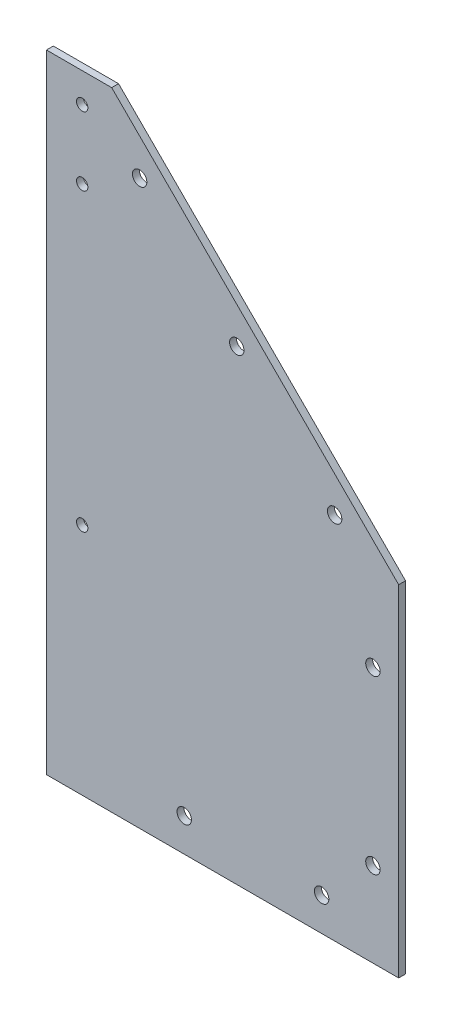
ISO-10303-21;
HEADER;
FILE_DESCRIPTION(('STEP AP214'),'2;1');
FILE_NAME('part.step','',(''),(''),'','','');
FILE_SCHEMA(('AUTOMOTIVE_DESIGN { 1 0 10303 214 1 1 1 1 }'));
ENDSEC;
DATA;
#1=APPLICATION_CONTEXT('core data for automotive mechanical design processes');
#2=APPLICATION_PROTOCOL_DEFINITION('international standard','automotive_design',2000,#1);
#3=PRODUCT_CONTEXT('',#1,'mechanical');
#4=PRODUCT('Part','Part','',(#3));
#5=PRODUCT_RELATED_PRODUCT_CATEGORY('part','',(#4));
#6=PRODUCT_DEFINITION_FORMATION('','',#4);
#7=PRODUCT_DEFINITION_CONTEXT('part definition',#1,'design');
#8=PRODUCT_DEFINITION('design','',#6,#7);
#9=PRODUCT_DEFINITION_SHAPE('','',#8);
#10=(LENGTH_UNIT() NAMED_UNIT(*) SI_UNIT(.MILLI.,.METRE.));
#11=(NAMED_UNIT(*) PLANE_ANGLE_UNIT() SI_UNIT($,.RADIAN.));
#12=(NAMED_UNIT(*) SI_UNIT($,.STERADIAN.) SOLID_ANGLE_UNIT());
#13=UNCERTAINTY_MEASURE_WITH_UNIT(LENGTH_MEASURE(1.E-05),#10,'distance_accuracy_value','');
#14=(GEOMETRIC_REPRESENTATION_CONTEXT(3) GLOBAL_UNCERTAINTY_ASSIGNED_CONTEXT((#13)) GLOBAL_UNIT_ASSIGNED_CONTEXT((#10,
#11,#12)) REPRESENTATION_CONTEXT('',''));
#15=CARTESIAN_POINT('',(0.,0.,0.));
#16=DIRECTION('',(0.,0.,1.));
#17=DIRECTION('',(1.,0.,0.));
#18=AXIS2_PLACEMENT_3D('',#15,#16,#17);
#19=CARTESIAN_POINT('',(0.,0.,2.));
#20=DIRECTION('',(0.,-1.,0.));
#21=DIRECTION('',(1.,0.,0.));
#22=AXIS2_PLACEMENT_3D('',#19,#20,#21);
#23=PLANE('',#22);
#24=DIRECTION('',(-1.,0.,0.));
#25=VECTOR('',#24,1.);
#26=CARTESIAN_POINT('',(0.,0.,0.));
#27=LINE('',#26,#25);
#28=CARTESIAN_POINT('',(83.56,0.,0.));
#29=VERTEX_POINT('',#28);
#30=CARTESIAN_POINT('',(-19.,0.,0.));
#31=VERTEX_POINT('',#30);
#32=EDGE_CURVE('E92',#29,#31,#27,.T.);
#33=ORIENTED_EDGE('',*,*,#32,.F.);
#34=DIRECTION('',(0.,0.,-1.));
#35=VECTOR('',#34,1.);
#36=CARTESIAN_POINT('',(83.56,0.,2.));
#37=LINE('',#36,#35);
#38=CARTESIAN_POINT('',(83.56,0.,2.));
#39=VERTEX_POINT('',#38);
#40=EDGE_CURVE('E11',#39,#29,#37,.T.);
#41=ORIENTED_EDGE('',*,*,#40,.F.);
#42=DIRECTION('',(-1.,0.,0.));
#43=VECTOR('',#42,1.);
#44=CARTESIAN_POINT('',(0.,0.,2.));
#45=LINE('',#44,#43);
#46=CARTESIAN_POINT('',(-19.,0.,2.));
#47=VERTEX_POINT('',#46);
#48=EDGE_CURVE('E89',#39,#47,#45,.T.);
#49=ORIENTED_EDGE('',*,*,#48,.T.);
#50=DIRECTION('',(0.,0.,1.));
#51=VECTOR('',#50,1.);
#52=CARTESIAN_POINT('',(-19.,0.,0.));
#53=LINE('',#52,#51);
#54=EDGE_CURVE('E206',#31,#47,#53,.T.);
#55=ORIENTED_EDGE('',*,*,#54,.F.);
#56=EDGE_LOOP('',(#33,#41,#49,#55));
#57=FACE_BOUND('',#56,.T.);
#58=ADVANCED_FACE('F37',(#57),#23,.T.);
#59=CARTESIAN_POINT('',(83.56,0.,2.));
#60=DIRECTION('',(1.,0.,0.));
#61=DIRECTION('',(0.,1.,0.));
#62=AXIS2_PLACEMENT_3D('',#59,#60,#61);
#63=PLANE('',#62);
#64=DIRECTION('',(0.,-1.,0.));
#65=VECTOR('',#64,1.);
#66=CARTESIAN_POINT('',(83.56,0.,0.));
#67=LINE('',#66,#65);
#68=CARTESIAN_POINT('',(83.56,99.17,0.));
#69=VERTEX_POINT('',#68);
#70=EDGE_CURVE('E126',#69,#29,#67,.T.);
#71=ORIENTED_EDGE('',*,*,#70,.F.);
#72=DIRECTION('',(0.,0.,-1.));
#73=VECTOR('',#72,1.);
#74=CARTESIAN_POINT('',(83.56,99.17,2.));
#75=LINE('',#74,#73);
#76=CARTESIAN_POINT('',(83.56,99.17,2.));
#77=VERTEX_POINT('',#76);
#78=EDGE_CURVE('E47',#77,#69,#75,.T.);
#79=ORIENTED_EDGE('',*,*,#78,.F.);
#80=DIRECTION('',(0.,-1.,0.));
#81=VECTOR('',#80,1.);
#82=CARTESIAN_POINT('',(83.56,0.,2.));
#83=LINE('',#82,#81);
#84=EDGE_CURVE('E98',#77,#39,#83,.T.);
#85=ORIENTED_EDGE('',*,*,#84,.T.);
#86=ORIENTED_EDGE('',*,*,#40,.T.);
#87=EDGE_LOOP('',(#71,#79,#85,#86));
#88=FACE_BOUND('',#87,.T.);
#89=ADVANCED_FACE('F103',(#88),#63,.T.);
#90=CARTESIAN_POINT('',(91.365,91.365,2.));
#91=DIRECTION('',(0.707106781186547,0.707106781186547,0.));
#92=DIRECTION('',(-0.707106781186548,0.707106781186548,0.));
#93=AXIS2_PLACEMENT_3D('',#90,#91,#92);
#94=PLANE('',#93);
#95=DIRECTION('',(0.707106781186548,-0.707106781186548,0.));
#96=VECTOR('',#95,1.);
#97=CARTESIAN_POINT('',(91.365,91.365,0.));
#98=LINE('',#97,#96);
#99=CARTESIAN_POINT('',(0.,182.73,0.));
#100=VERTEX_POINT('',#99);
#101=EDGE_CURVE('E128',#100,#69,#98,.T.);
#102=ORIENTED_EDGE('',*,*,#101,.F.);
#103=DIRECTION('',(0.,0.,-1.));
#104=VECTOR('',#103,1.);
#105=CARTESIAN_POINT('',(0.,182.73,2.));
#106=LINE('',#105,#104);
#107=CARTESIAN_POINT('',(0.,182.73,2.));
#108=VERTEX_POINT('',#107);
#109=EDGE_CURVE('E56',#108,#100,#106,.T.);
#110=ORIENTED_EDGE('',*,*,#109,.F.);
#111=DIRECTION('',(0.707106781186548,-0.707106781186548,0.));
#112=VECTOR('',#111,1.);
#113=CARTESIAN_POINT('',(91.365,91.365,2.));
#114=LINE('',#113,#112);
#115=EDGE_CURVE('E104',#108,#77,#114,.T.);
#116=ORIENTED_EDGE('',*,*,#115,.T.);
#117=ORIENTED_EDGE('',*,*,#78,.T.);
#118=EDGE_LOOP('',(#102,#110,#116,#117));
#119=FACE_BOUND('',#118,.T.);
#120=ADVANCED_FACE('F164',(#119),#94,.T.);
#121=CARTESIAN_POINT('',(8.13291965083095,163.990478631371,2.));
#122=DIRECTION('',(0.,0.,-1.));
#123=DIRECTION('',(-1.,0.,0.));
#124=AXIS2_PLACEMENT_3D('',#121,#122,#123);
#125=CYLINDRICAL_SURFACE('',#124,2.10000000000004);
#126=CARTESIAN_POINT('',(8.13291965083095,163.990478631371,2.));
#127=DIRECTION('',(0.,0.,1.));
#128=DIRECTION('',(1.,0.,0.));
#129=AXIS2_PLACEMENT_3D('',#126,#127,#128);
#130=CIRCLE('',#129,2.10000000000004);
#131=CARTESIAN_POINT('',(10.232919650831,163.990478631371,2.));
#132=VERTEX_POINT('',#131);
#133=EDGE_CURVE('E101',#132,#132,#130,.T.);
#134=ORIENTED_EDGE('',*,*,#133,.T.);
#135=EDGE_LOOP('',(#134));
#136=FACE_BOUND('',#135,.T.);
#137=CARTESIAN_POINT('',(8.13291965083095,163.990478631371,0.));
#138=DIRECTION('',(0.,0.,1.));
#139=DIRECTION('',(1.,0.,0.));
#140=AXIS2_PLACEMENT_3D('',#137,#138,#139);
#141=CIRCLE('',#140,2.10000000000004);
#142=CARTESIAN_POINT('',(10.232919650831,163.990478631371,0.));
#143=VERTEX_POINT('',#142);
#144=EDGE_CURVE('E122',#143,#143,#141,.T.);
#145=ORIENTED_EDGE('',*,*,#144,.F.);
#146=EDGE_LOOP('',(#145));
#147=FACE_BOUND('',#146,.T.);
#148=ADVANCED_FACE('F168',(#136,#147),#125,.F.);
#149=CARTESIAN_POINT('',(36.4171908982929,135.706207383909,2.));
#150=DIRECTION('',(0.,0.,-1.));
#151=DIRECTION('',(-1.,0.,0.));
#152=AXIS2_PLACEMENT_3D('',#149,#150,#151);
#153=CYLINDRICAL_SURFACE('',#152,2.09999999999999);
#154=CARTESIAN_POINT('',(36.4171908982929,135.706207383909,2.));
#155=DIRECTION('',(0.,0.,1.));
#156=DIRECTION('',(1.,0.,0.));
#157=AXIS2_PLACEMENT_3D('',#154,#155,#156);
#158=CIRCLE('',#157,2.09999999999999);
#159=CARTESIAN_POINT('',(38.5171908982928,135.706207383909,2.));
#160=VERTEX_POINT('',#159);
#161=EDGE_CURVE('E232',#160,#160,#158,.T.);
#162=ORIENTED_EDGE('',*,*,#161,.T.);
#163=EDGE_LOOP('',(#162));
#164=FACE_BOUND('',#163,.T.);
#165=CARTESIAN_POINT('',(36.4171908982929,135.706207383909,0.));
#166=DIRECTION('',(0.,0.,1.));
#167=DIRECTION('',(1.,0.,0.));
#168=AXIS2_PLACEMENT_3D('',#165,#166,#167);
#169=CIRCLE('',#168,2.09999999999999);
#170=CARTESIAN_POINT('',(38.5171908982928,135.706207383909,0.));
#171=VERTEX_POINT('',#170);
#172=EDGE_CURVE('E119',#171,#171,#169,.T.);
#173=ORIENTED_EDGE('',*,*,#172,.F.);
#174=EDGE_LOOP('',(#173));
#175=FACE_BOUND('',#174,.T.);
#176=ADVANCED_FACE('F171',(#164,#175),#153,.F.);
#177=CARTESIAN_POINT('',(64.9100261398927,107.42849037455,2.));
#178=DIRECTION('',(0.,0.,-1.));
#179=DIRECTION('',(-1.,0.,0.));
#180=AXIS2_PLACEMENT_3D('',#177,#178,#179);
#181=CYLINDRICAL_SURFACE('',#180,2.1);
#182=CARTESIAN_POINT('',(64.9100261398927,107.42849037455,2.));
#183=DIRECTION('',(0.,0.,1.));
#184=DIRECTION('',(1.,0.,0.));
#185=AXIS2_PLACEMENT_3D('',#182,#183,#184);
#186=CIRCLE('',#185,2.1);
#187=CARTESIAN_POINT('',(67.0100261398927,107.42849037455,2.));
#188=VERTEX_POINT('',#187);
#189=EDGE_CURVE('E229',#188,#188,#186,.T.);
#190=ORIENTED_EDGE('',*,*,#189,.T.);
#191=EDGE_LOOP('',(#190));
#192=FACE_BOUND('',#191,.T.);
#193=CARTESIAN_POINT('',(64.9100261398927,107.42849037455,0.));
#194=DIRECTION('',(0.,0.,1.));
#195=DIRECTION('',(1.,0.,0.));
#196=AXIS2_PLACEMENT_3D('',#193,#194,#195);
#197=CIRCLE('',#196,2.1);
#198=CARTESIAN_POINT('',(67.0100261398927,107.42849037455,0.));
#199=VERTEX_POINT('',#198);
#200=EDGE_CURVE('E116',#199,#199,#197,.T.);
#201=ORIENTED_EDGE('',*,*,#200,.F.);
#202=EDGE_LOOP('',(#201));
#203=FACE_BOUND('',#202,.T.);
#204=ADVANCED_FACE('F175',(#192,#203),#181,.F.);
#205=CARTESIAN_POINT('',(76.06,74.59,2.));
#206=DIRECTION('',(0.,0.,-1.));
#207=DIRECTION('',(-1.,0.,0.));
#208=AXIS2_PLACEMENT_3D('',#205,#206,#207);
#209=CYLINDRICAL_SURFACE('',#208,2.1);
#210=CARTESIAN_POINT('',(76.06,74.59,2.));
#211=DIRECTION('',(0.,0.,1.));
#212=DIRECTION('',(1.,0.,0.));
#213=AXIS2_PLACEMENT_3D('',#210,#211,#212);
#214=CIRCLE('',#213,2.1);
#215=CARTESIAN_POINT('',(78.16,74.59,2.));
#216=VERTEX_POINT('',#215);
#217=EDGE_CURVE('E189',#216,#216,#214,.T.);
#218=ORIENTED_EDGE('',*,*,#217,.T.);
#219=EDGE_LOOP('',(#218));
#220=FACE_BOUND('',#219,.T.);
#221=CARTESIAN_POINT('',(76.06,74.59,0.));
#222=DIRECTION('',(0.,0.,1.));
#223=DIRECTION('',(1.,0.,0.));
#224=AXIS2_PLACEMENT_3D('',#221,#222,#223);
#225=CIRCLE('',#224,2.1);
#226=CARTESIAN_POINT('',(78.16,74.59,0.));
#227=VERTEX_POINT('',#226);
#228=EDGE_CURVE('E112',#227,#227,#225,.T.);
#229=ORIENTED_EDGE('',*,*,#228,.F.);
#230=EDGE_LOOP('',(#229));
#231=FACE_BOUND('',#230,.T.);
#232=ADVANCED_FACE('F178',(#220,#231),#209,.F.);
#233=CARTESIAN_POINT('',(76.06,24.59,2.));
#234=DIRECTION('',(0.,0.,-1.));
#235=DIRECTION('',(-1.,0.,0.));
#236=AXIS2_PLACEMENT_3D('',#233,#234,#235);
#237=CYLINDRICAL_SURFACE('',#236,2.1);
#238=CARTESIAN_POINT('',(76.06,24.59,2.));
#239=DIRECTION('',(0.,0.,1.));
#240=DIRECTION('',(1.,0.,0.));
#241=AXIS2_PLACEMENT_3D('',#238,#239,#240);
#242=CIRCLE('',#241,2.1);
#243=CARTESIAN_POINT('',(78.16,24.59,2.));
#244=VERTEX_POINT('',#243);
#245=EDGE_CURVE('E131',#244,#244,#242,.T.);
#246=ORIENTED_EDGE('',*,*,#245,.T.);
#247=EDGE_LOOP('',(#246));
#248=FACE_BOUND('',#247,.T.);
#249=CARTESIAN_POINT('',(76.06,24.59,0.));
#250=DIRECTION('',(0.,0.,1.));
#251=DIRECTION('',(1.,0.,0.));
#252=AXIS2_PLACEMENT_3D('',#249,#250,#251);
#253=CIRCLE('',#252,2.1);
#254=CARTESIAN_POINT('',(78.16,24.59,0.));
#255=VERTEX_POINT('',#254);
#256=EDGE_CURVE('E109',#255,#255,#253,.T.);
#257=ORIENTED_EDGE('',*,*,#256,.F.);
#258=EDGE_LOOP('',(#257));
#259=FACE_BOUND('',#258,.T.);
#260=ADVANCED_FACE('F39',(#248,#259),#237,.F.);
#261=CARTESIAN_POINT('',(0.,0.,2.));
#262=DIRECTION('',(0.,0.,1.));
#263=DIRECTION('',(1.,0.,0.));
#264=AXIS2_PLACEMENT_3D('',#261,#262,#263);
#265=PLANE('',#264);
#266=CARTESIAN_POINT('',(-8.59,174.15,2.));
#267=DIRECTION('',(0.,0.,1.));
#268=DIRECTION('',(1.,0.,0.));
#269=AXIS2_PLACEMENT_3D('',#266,#267,#268);
#270=CIRCLE('',#269,1.64999999999999);
#271=CARTESIAN_POINT('',(-6.94000000000001,174.15,2.));
#272=VERTEX_POINT('',#271);
#273=EDGE_CURVE('E361',#272,#272,#270,.T.);
#274=ORIENTED_EDGE('',*,*,#273,.F.);
#275=EDGE_LOOP('',(#274));
#276=FACE_BOUND('',#275,.T.);
#277=CARTESIAN_POINT('',(-8.58999999999999,154.15,2.));
#278=DIRECTION('',(0.,0.,1.));
#279=DIRECTION('',(1.,0.,0.));
#280=AXIS2_PLACEMENT_3D('',#277,#278,#279);
#281=CIRCLE('',#280,1.64999999999999);
#282=CARTESIAN_POINT('',(-6.94,154.15,2.));
#283=VERTEX_POINT('',#282);
#284=EDGE_CURVE('E365',#283,#283,#281,.T.);
#285=ORIENTED_EDGE('',*,*,#284,.F.);
#286=EDGE_LOOP('',(#285));
#287=FACE_BOUND('',#286,.T.);
#288=CARTESIAN_POINT('',(-8.58999999999999,68.15,2.));
#289=DIRECTION('',(0.,0.,1.));
#290=DIRECTION('',(1.,0.,0.));
#291=AXIS2_PLACEMENT_3D('',#288,#289,#290);
#292=CIRCLE('',#291,1.64999999999999);
#293=CARTESIAN_POINT('',(-6.94,68.15,2.));
#294=VERTEX_POINT('',#293);
#295=EDGE_CURVE('E208',#294,#294,#292,.T.);
#296=ORIENTED_EDGE('',*,*,#295,.F.);
#297=EDGE_LOOP('',(#296));
#298=FACE_BOUND('',#297,.T.);
#299=CARTESIAN_POINT('',(21.12,9.69,2.));
#300=DIRECTION('',(0.,0.,1.));
#301=DIRECTION('',(1.,0.,0.));
#302=AXIS2_PLACEMENT_3D('',#299,#300,#301);
#303=CIRCLE('',#302,2.1);
#304=CARTESIAN_POINT('',(23.22,9.69,2.));
#305=VERTEX_POINT('',#304);
#306=EDGE_CURVE('E136',#305,#305,#303,.T.);
#307=ORIENTED_EDGE('',*,*,#306,.F.);
#308=EDGE_LOOP('',(#307));
#309=FACE_BOUND('',#308,.T.);
#310=CARTESIAN_POINT('',(61.12,9.69,2.));
#311=DIRECTION('',(0.,0.,1.));
#312=DIRECTION('',(1.,0.,0.));
#313=AXIS2_PLACEMENT_3D('',#310,#311,#312);
#314=CIRCLE('',#313,2.1);
#315=CARTESIAN_POINT('',(63.22,9.69,2.));
#316=VERTEX_POINT('',#315);
#317=EDGE_CURVE('E222',#316,#316,#314,.T.);
#318=ORIENTED_EDGE('',*,*,#317,.F.);
#319=EDGE_LOOP('',(#318));
#320=FACE_BOUND('',#319,.T.);
#321=ORIENTED_EDGE('',*,*,#245,.F.);
#322=EDGE_LOOP('',(#321));
#323=FACE_BOUND('',#322,.T.);
#324=ORIENTED_EDGE('',*,*,#217,.F.);
#325=EDGE_LOOP('',(#324));
#326=FACE_BOUND('',#325,.T.);
#327=ORIENTED_EDGE('',*,*,#189,.F.);
#328=EDGE_LOOP('',(#327));
#329=FACE_BOUND('',#328,.T.);
#330=ORIENTED_EDGE('',*,*,#161,.F.);
#331=EDGE_LOOP('',(#330));
#332=FACE_BOUND('',#331,.T.);
#333=ORIENTED_EDGE('',*,*,#133,.F.);
#334=EDGE_LOOP('',(#333));
#335=FACE_BOUND('',#334,.T.);
#336=ORIENTED_EDGE('',*,*,#48,.F.);
#337=ORIENTED_EDGE('',*,*,#84,.F.);
#338=ORIENTED_EDGE('',*,*,#115,.F.);
#339=DIRECTION('',(1.,0.,0.));
#340=VECTOR('',#339,1.);
#341=CARTESIAN_POINT('',(-19.,182.73,1.99999999999998));
#342=LINE('',#341,#340);
#343=CARTESIAN_POINT('',(-19.,182.73,1.99999999999998));
#344=VERTEX_POINT('',#343);
#345=EDGE_CURVE('E219',#344,#108,#342,.T.);
#346=ORIENTED_EDGE('',*,*,#345,.F.);
#347=DIRECTION('',(0.,1.,0.));
#348=VECTOR('',#347,1.);
#349=CARTESIAN_POINT('',(-19.,182.73,1.99999999999998));
#350=LINE('',#349,#348);
#351=EDGE_CURVE('E100',#47,#344,#350,.T.);
#352=ORIENTED_EDGE('',*,*,#351,.F.);
#353=EDGE_LOOP('',(#336,#337,#338,#346,#352));
#354=FACE_BOUND('',#353,.T.);
#355=ADVANCED_FACE('F97',(#276,#287,#298,#309,#320,#323,#326,#329,#332,#335,#354),#265,.T.);
#356=CARTESIAN_POINT('',(0.,0.,0.));
#357=DIRECTION('',(0.,0.,1.));
#358=DIRECTION('',(1.,0.,0.));
#359=AXIS2_PLACEMENT_3D('',#356,#357,#358);
#360=PLANE('',#359);
#361=CARTESIAN_POINT('',(-8.59,174.15,0.));
#362=DIRECTION('',(0.,0.,1.));
#363=DIRECTION('',(1.,0.,0.));
#364=AXIS2_PLACEMENT_3D('',#361,#362,#363);
#365=CIRCLE('',#364,1.64999999999999);
#366=CARTESIAN_POINT('',(-6.94000000000001,174.15,0.));
#367=VERTEX_POINT('',#366);
#368=EDGE_CURVE('E364',#367,#367,#365,.T.);
#369=ORIENTED_EDGE('',*,*,#368,.T.);
#370=EDGE_LOOP('',(#369));
#371=FACE_BOUND('',#370,.T.);
#372=CARTESIAN_POINT('',(-8.58999999999999,154.15,0.));
#373=DIRECTION('',(0.,0.,1.));
#374=DIRECTION('',(1.,0.,0.));
#375=AXIS2_PLACEMENT_3D('',#372,#373,#374);
#376=CIRCLE('',#375,1.64999999999999);
#377=CARTESIAN_POINT('',(-6.94000000000001,154.15,0.));
#378=VERTEX_POINT('',#377);
#379=EDGE_CURVE('E41',#378,#378,#376,.T.);
#380=ORIENTED_EDGE('',*,*,#379,.T.);
#381=EDGE_LOOP('',(#380));
#382=FACE_BOUND('',#381,.T.);
#383=CARTESIAN_POINT('',(-8.58999999999999,68.15,0.));
#384=DIRECTION('',(0.,0.,-1.));
#385=DIRECTION('',(-1.,0.,0.));
#386=AXIS2_PLACEMENT_3D('',#383,#384,#385);
#387=CIRCLE('',#386,1.64999999999999);
#388=CARTESIAN_POINT('',(-10.24,68.15,0.));
#389=VERTEX_POINT('',#388);
#390=EDGE_CURVE('E211',#389,#389,#387,.T.);
#391=ORIENTED_EDGE('',*,*,#390,.F.);
#392=EDGE_LOOP('',(#391));
#393=FACE_BOUND('',#392,.T.);
#394=CARTESIAN_POINT('',(21.12,9.69,0.));
#395=DIRECTION('',(0.,0.,1.));
#396=DIRECTION('',(1.,0.,0.));
#397=AXIS2_PLACEMENT_3D('',#394,#395,#396);
#398=CIRCLE('',#397,2.1);
#399=CARTESIAN_POINT('',(23.22,9.69,0.));
#400=VERTEX_POINT('',#399);
#401=EDGE_CURVE('E113',#400,#400,#398,.T.);
#402=ORIENTED_EDGE('',*,*,#401,.T.);
#403=EDGE_LOOP('',(#402));
#404=FACE_BOUND('',#403,.T.);
#405=CARTESIAN_POINT('',(61.12,9.69,0.));
#406=DIRECTION('',(0.,0.,1.));
#407=DIRECTION('',(1.,0.,0.));
#408=AXIS2_PLACEMENT_3D('',#405,#406,#407);
#409=CIRCLE('',#408,2.1);
#410=CARTESIAN_POINT('',(63.22,9.69,0.));
#411=VERTEX_POINT('',#410);
#412=EDGE_CURVE('E134',#411,#411,#409,.T.);
#413=ORIENTED_EDGE('',*,*,#412,.T.);
#414=EDGE_LOOP('',(#413));
#415=FACE_BOUND('',#414,.T.);
#416=ORIENTED_EDGE('',*,*,#256,.T.);
#417=EDGE_LOOP('',(#416));
#418=FACE_BOUND('',#417,.T.);
#419=ORIENTED_EDGE('',*,*,#228,.T.);
#420=EDGE_LOOP('',(#419));
#421=FACE_BOUND('',#420,.T.);
#422=ORIENTED_EDGE('',*,*,#200,.T.);
#423=EDGE_LOOP('',(#422));
#424=FACE_BOUND('',#423,.T.);
#425=ORIENTED_EDGE('',*,*,#172,.T.);
#426=EDGE_LOOP('',(#425));
#427=FACE_BOUND('',#426,.T.);
#428=ORIENTED_EDGE('',*,*,#144,.T.);
#429=EDGE_LOOP('',(#428));
#430=FACE_BOUND('',#429,.T.);
#431=ORIENTED_EDGE('',*,*,#32,.T.);
#432=DIRECTION('',(0.,-1.,0.));
#433=VECTOR('',#432,1.);
#434=CARTESIAN_POINT('',(-19.,182.73,0.));
#435=LINE('',#434,#433);
#436=CARTESIAN_POINT('',(-19.,182.73,0.));
#437=VERTEX_POINT('',#436);
#438=EDGE_CURVE('E204',#437,#31,#435,.T.);
#439=ORIENTED_EDGE('',*,*,#438,.F.);
#440=DIRECTION('',(1.,0.,0.));
#441=VECTOR('',#440,1.);
#442=CARTESIAN_POINT('',(-19.,182.73,0.));
#443=LINE('',#442,#441);
#444=EDGE_CURVE('E217',#437,#100,#443,.T.);
#445=ORIENTED_EDGE('',*,*,#444,.T.);
#446=ORIENTED_EDGE('',*,*,#101,.T.);
#447=ORIENTED_EDGE('',*,*,#70,.T.);
#448=EDGE_LOOP('',(#431,#439,#445,#446,#447));
#449=FACE_BOUND('',#448,.T.);
#450=ADVANCED_FACE('F140',(#371,#382,#393,#404,#415,#418,#421,#424,#427,#430,#449),#360,.F.);
#451=CARTESIAN_POINT('',(61.12,9.69,-8.));
#452=DIRECTION('',(0.,0.,1.));
#453=DIRECTION('',(1.,0.,0.));
#454=AXIS2_PLACEMENT_3D('',#451,#452,#453);
#455=CYLINDRICAL_SURFACE('',#454,2.1);
#456=ORIENTED_EDGE('',*,*,#317,.T.);
#457=EDGE_LOOP('',(#456));
#458=FACE_BOUND('',#457,.T.);
#459=ORIENTED_EDGE('',*,*,#412,.F.);
#460=EDGE_LOOP('',(#459));
#461=FACE_BOUND('',#460,.T.);
#462=ADVANCED_FACE('F146',(#458,#461),#455,.F.);
#463=CARTESIAN_POINT('',(21.12,9.69,-8.));
#464=DIRECTION('',(0.,0.,1.));
#465=DIRECTION('',(1.,0.,0.));
#466=AXIS2_PLACEMENT_3D('',#463,#464,#465);
#467=CYLINDRICAL_SURFACE('',#466,2.1);
#468=ORIENTED_EDGE('',*,*,#306,.T.);
#469=EDGE_LOOP('',(#468));
#470=FACE_BOUND('',#469,.T.);
#471=ORIENTED_EDGE('',*,*,#401,.F.);
#472=EDGE_LOOP('',(#471));
#473=FACE_BOUND('',#472,.T.);
#474=ADVANCED_FACE('F143',(#470,#473),#467,.F.);
#475=CARTESIAN_POINT('',(-19.,182.73,0.));
#476=DIRECTION('',(0.,-1.,0.));
#477=DIRECTION('',(0.,0.,-1.));
#478=AXIS2_PLACEMENT_3D('',#475,#476,#477);
#479=PLANE('',#478);
#480=ORIENTED_EDGE('',*,*,#109,.T.);
#481=ORIENTED_EDGE('',*,*,#444,.F.);
#482=DIRECTION('',(0.,0.,-1.));
#483=VECTOR('',#482,1.);
#484=CARTESIAN_POINT('',(-19.,182.73,0.));
#485=LINE('',#484,#483);
#486=EDGE_CURVE('E77',#344,#437,#485,.T.);
#487=ORIENTED_EDGE('',*,*,#486,.F.);
#488=ORIENTED_EDGE('',*,*,#345,.T.);
#489=EDGE_LOOP('',(#480,#481,#487,#488));
#490=FACE_BOUND('',#489,.T.);
#491=ADVANCED_FACE('F145',(#490),#479,.F.);
#492=CARTESIAN_POINT('',(-19.,0.,0.));
#493=DIRECTION('',(-1.,0.,0.));
#494=DIRECTION('',(0.,0.,1.));
#495=AXIS2_PLACEMENT_3D('',#492,#493,#494);
#496=PLANE('',#495);
#497=ORIENTED_EDGE('',*,*,#438,.T.);
#498=ORIENTED_EDGE('',*,*,#54,.T.);
#499=ORIENTED_EDGE('',*,*,#351,.T.);
#500=ORIENTED_EDGE('',*,*,#486,.T.);
#501=EDGE_LOOP('',(#497,#498,#499,#500));
#502=FACE_BOUND('',#501,.T.);
#503=ADVANCED_FACE('F153',(#502),#496,.T.);
#504=CARTESIAN_POINT('',(-8.58999999999999,68.15,0.));
#505=DIRECTION('',(0.,0.,-1.));
#506=DIRECTION('',(-1.,0.,0.));
#507=AXIS2_PLACEMENT_3D('',#504,#505,#506);
#508=CYLINDRICAL_SURFACE('',#507,1.64999999999999);
#509=ORIENTED_EDGE('',*,*,#295,.T.);
#510=EDGE_LOOP('',(#509));
#511=FACE_BOUND('',#510,.T.);
#512=ORIENTED_EDGE('',*,*,#390,.T.);
#513=EDGE_LOOP('',(#512));
#514=FACE_BOUND('',#513,.T.);
#515=ADVANCED_FACE('F320',(#511,#514),#508,.F.);
#516=CARTESIAN_POINT('',(-8.58999999999999,154.15,2.));
#517=DIRECTION('',(0.,0.,1.));
#518=DIRECTION('',(1.,0.,0.));
#519=AXIS2_PLACEMENT_3D('',#516,#517,#518);
#520=CYLINDRICAL_SURFACE('',#519,1.64999999999999);
#521=ORIENTED_EDGE('',*,*,#284,.T.);
#522=EDGE_LOOP('',(#521));
#523=FACE_BOUND('',#522,.T.);
#524=ORIENTED_EDGE('',*,*,#379,.F.);
#525=EDGE_LOOP('',(#524));
#526=FACE_BOUND('',#525,.T.);
#527=ADVANCED_FACE('F328',(#523,#526),#520,.F.);
#528=CARTESIAN_POINT('',(-8.59,174.15,2.));
#529=DIRECTION('',(0.,0.,1.));
#530=DIRECTION('',(1.,0.,0.));
#531=AXIS2_PLACEMENT_3D('',#528,#529,#530);
#532=CYLINDRICAL_SURFACE('',#531,1.64999999999999);
#533=ORIENTED_EDGE('',*,*,#273,.T.);
#534=EDGE_LOOP('',(#533));
#535=FACE_BOUND('',#534,.T.);
#536=ORIENTED_EDGE('',*,*,#368,.F.);
#537=EDGE_LOOP('',(#536));
#538=FACE_BOUND('',#537,.T.);
#539=ADVANCED_FACE('F338',(#535,#538),#532,.F.);
#540=CLOSED_SHELL('',(#58,#89,#120,#148,#176,#204,#232,#260,#355,#450,#462,#474,#491,#503,#515,
#527,#539));
#541=MANIFOLD_SOLID_BREP('B2',#540);
#542=ADVANCED_BREP_SHAPE_REPRESENTATION('',(#18,#541),#14);
#543=SHAPE_DEFINITION_REPRESENTATION(#9,#542);
ENDSEC;
END-ISO-10303-21;
